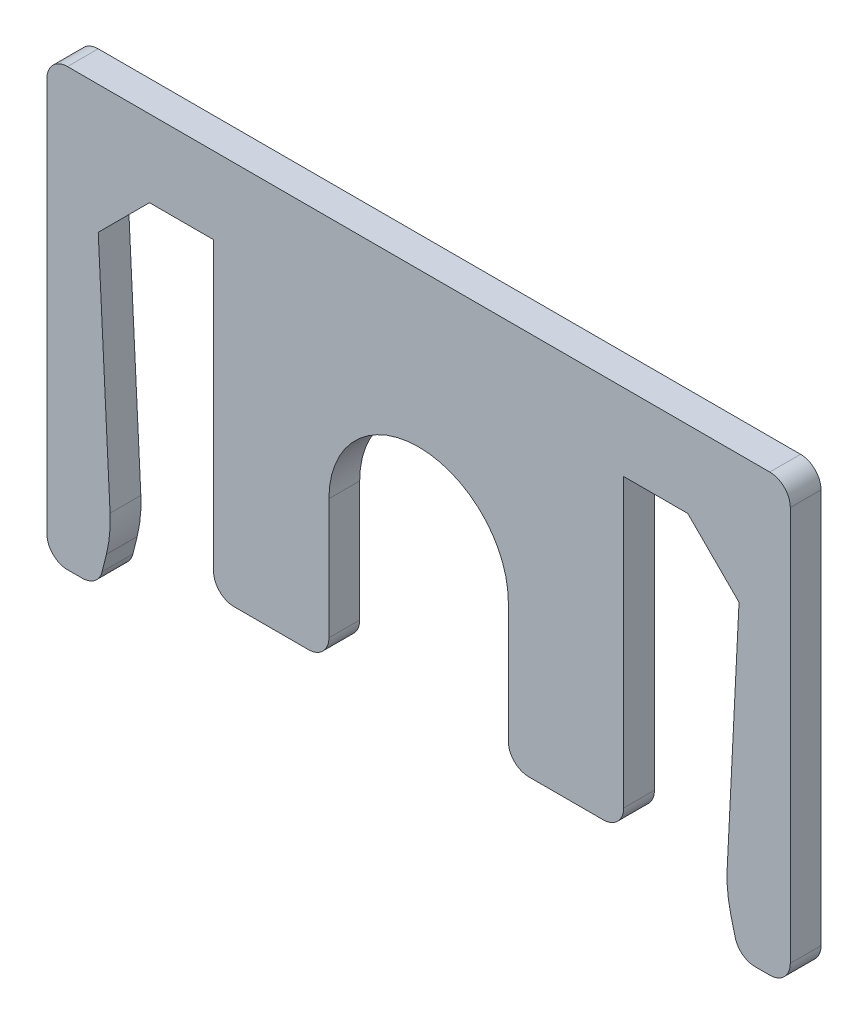
ISO-10303-21;
HEADER;
FILE_DESCRIPTION(('STEP AP214'),'2;1');
FILE_NAME('part.step','',(''),(''),'','','');
FILE_SCHEMA(('AUTOMOTIVE_DESIGN { 1 0 10303 214 1 1 1 1 }'));
ENDSEC;
DATA;
#1=APPLICATION_CONTEXT('core data for automotive mechanical design processes');
#2=APPLICATION_PROTOCOL_DEFINITION('international standard','automotive_design',2000,#1);
#3=PRODUCT_CONTEXT('',#1,'mechanical');
#4=PRODUCT('Part','Part','',(#3));
#5=PRODUCT_RELATED_PRODUCT_CATEGORY('part','',(#4));
#6=PRODUCT_DEFINITION_FORMATION('','',#4);
#7=PRODUCT_DEFINITION_CONTEXT('part definition',#1,'design');
#8=PRODUCT_DEFINITION('design','',#6,#7);
#9=PRODUCT_DEFINITION_SHAPE('','',#8);
#10=(LENGTH_UNIT() NAMED_UNIT(*) SI_UNIT(.MILLI.,.METRE.));
#11=(NAMED_UNIT(*) PLANE_ANGLE_UNIT() SI_UNIT($,.RADIAN.));
#12=(NAMED_UNIT(*) SI_UNIT($,.STERADIAN.) SOLID_ANGLE_UNIT());
#13=UNCERTAINTY_MEASURE_WITH_UNIT(LENGTH_MEASURE(1.E-05),#10,'distance_accuracy_value','');
#14=(GEOMETRIC_REPRESENTATION_CONTEXT(3) GLOBAL_UNCERTAINTY_ASSIGNED_CONTEXT((#13)) GLOBAL_UNIT_ASSIGNED_CONTEXT((#10,
#11,#12)) REPRESENTATION_CONTEXT('',''));
#15=CARTESIAN_POINT('',(0.,0.,0.));
#16=DIRECTION('',(0.,0.,1.));
#17=DIRECTION('',(1.,0.,0.));
#18=AXIS2_PLACEMENT_3D('',#15,#16,#17);
#19=CARTESIAN_POINT('',(-10.5,0.,1.2));
#20=DIRECTION('',(0.,1.,0.));
#21=DIRECTION('',(-1.,0.,0.));
#22=AXIS2_PLACEMENT_3D('',#19,#20,#21);
#23=PLANE('',#22);
#24=DIRECTION('',(1.,0.,0.));
#25=VECTOR('',#24,1.);
#26=CARTESIAN_POINT('',(-10.5,0.,0.));
#27=LINE('',#26,#25);
#28=CARTESIAN_POINT('',(-10.5,0.,0.));
#29=VERTEX_POINT('',#28);
#30=CARTESIAN_POINT('',(-8.,0.,0.));
#31=VERTEX_POINT('',#30);
#32=EDGE_CURVE('E277',#29,#31,#27,.T.);
#33=ORIENTED_EDGE('',*,*,#32,.T.);
#34=DIRECTION('',(0.,0.,-1.));
#35=VECTOR('',#34,1.);
#36=CARTESIAN_POINT('',(-8.,0.,1.2));
#37=LINE('',#36,#35);
#38=CARTESIAN_POINT('',(-8.,0.,1.2));
#39=VERTEX_POINT('',#38);
#40=EDGE_CURVE('E256',#39,#31,#37,.T.);
#41=ORIENTED_EDGE('',*,*,#40,.F.);
#42=DIRECTION('',(1.,0.,0.));
#43=VECTOR('',#42,1.);
#44=CARTESIAN_POINT('',(-10.5,0.,1.2));
#45=LINE('',#44,#43);
#46=CARTESIAN_POINT('',(-10.5,0.,1.2));
#47=VERTEX_POINT('',#46);
#48=EDGE_CURVE('E263',#47,#39,#45,.T.);
#49=ORIENTED_EDGE('',*,*,#48,.F.);
#50=DIRECTION('',(0.,0.,-1.));
#51=VECTOR('',#50,1.);
#52=CARTESIAN_POINT('',(-10.5,0.,1.2));
#53=LINE('',#52,#51);
#54=EDGE_CURVE('E518',#47,#29,#53,.T.);
#55=ORIENTED_EDGE('',*,*,#54,.T.);
#56=EDGE_LOOP('',(#33,#41,#49,#55));
#57=FACE_BOUND('',#56,.T.);
#58=ADVANCED_FACE('F39',(#57),#23,.F.);
#59=CARTESIAN_POINT('',(-8.,-12.,1.2));
#60=DIRECTION('',(1.,0.,0.));
#61=DIRECTION('',(0.,0.,-1.));
#62=AXIS2_PLACEMENT_3D('',#59,#60,#61);
#63=PLANE('',#62);
#64=DIRECTION('',(0.,-1.,0.));
#65=VECTOR('',#64,1.);
#66=CARTESIAN_POINT('',(-8.,-12.,0.));
#67=LINE('',#66,#65);
#68=CARTESIAN_POINT('',(-8.,-11.2,0.));
#69=VERTEX_POINT('',#68);
#70=EDGE_CURVE('E549',#31,#69,#67,.T.);
#71=ORIENTED_EDGE('',*,*,#70,.T.);
#72=DIRECTION('',(0.,0.,-1.));
#73=VECTOR('',#72,1.);
#74=CARTESIAN_POINT('',(-8.,-11.2,1.2));
#75=LINE('',#74,#73);
#76=CARTESIAN_POINT('',(-8.,-11.2,1.2));
#77=VERTEX_POINT('',#76);
#78=EDGE_CURVE('E259',#69,#77,#75,.F.);
#79=ORIENTED_EDGE('',*,*,#78,.T.);
#80=DIRECTION('',(0.,-1.,0.));
#81=VECTOR('',#80,1.);
#82=CARTESIAN_POINT('',(-8.,-12.,1.2));
#83=LINE('',#82,#81);
#84=EDGE_CURVE('E251',#39,#77,#83,.T.);
#85=ORIENTED_EDGE('',*,*,#84,.F.);
#86=ORIENTED_EDGE('',*,*,#40,.T.);
#87=EDGE_LOOP('',(#71,#79,#85,#86));
#88=FACE_BOUND('',#87,.T.);
#89=ADVANCED_FACE('F254',(#88),#63,.F.);
#90=CARTESIAN_POINT('',(-8.,-12.,1.2));
#91=DIRECTION('',(0.,1.,0.));
#92=DIRECTION('',(-1.,0.,0.));
#93=AXIS2_PLACEMENT_3D('',#90,#91,#92);
#94=PLANE('',#93);
#95=DIRECTION('',(1.,0.,0.));
#96=VECTOR('',#95,1.);
#97=CARTESIAN_POINT('',(-8.,-12.,1.2));
#98=LINE('',#97,#96);
#99=CARTESIAN_POINT('',(-7.2,-12.,1.2));
#100=VERTEX_POINT('',#99);
#101=CARTESIAN_POINT('',(-4.3,-12.,1.2));
#102=VERTEX_POINT('',#101);
#103=EDGE_CURVE('E262',#100,#102,#98,.T.);
#104=ORIENTED_EDGE('',*,*,#103,.F.);
#105=DIRECTION('',(0.,0.,-1.));
#106=VECTOR('',#105,1.);
#107=CARTESIAN_POINT('',(-7.2,-12.,1.2));
#108=LINE('',#107,#106);
#109=CARTESIAN_POINT('',(-7.2,-12.,0.));
#110=VERTEX_POINT('',#109);
#111=EDGE_CURVE('E418',#100,#110,#108,.T.);
#112=ORIENTED_EDGE('',*,*,#111,.T.);
#113=DIRECTION('',(1.,0.,0.));
#114=VECTOR('',#113,1.);
#115=CARTESIAN_POINT('',(-8.,-12.,0.));
#116=LINE('',#115,#114);
#117=CARTESIAN_POINT('',(-4.3,-12.,0.));
#118=VERTEX_POINT('',#117);
#119=EDGE_CURVE('E543',#110,#118,#116,.T.);
#120=ORIENTED_EDGE('',*,*,#119,.T.);
#121=DIRECTION('',(0.,0.,-1.));
#122=VECTOR('',#121,1.);
#123=CARTESIAN_POINT('',(-4.3,-12.,1.2));
#124=LINE('',#123,#122);
#125=EDGE_CURVE('E415',#118,#102,#124,.F.);
#126=ORIENTED_EDGE('',*,*,#125,.T.);
#127=EDGE_LOOP('',(#104,#112,#120,#126));
#128=FACE_BOUND('',#127,.T.);
#129=ADVANCED_FACE('F624',(#128),#94,.F.);
#130=CARTESIAN_POINT('',(-3.5,-6.5,1.2));
#131=DIRECTION('',(-1.,0.,0.));
#132=DIRECTION('',(0.,-1.,0.));
#133=AXIS2_PLACEMENT_3D('',#130,#131,#132);
#134=PLANE('',#133);
#135=DIRECTION('',(0.,1.,0.));
#136=VECTOR('',#135,1.);
#137=CARTESIAN_POINT('',(-3.5,-6.5,1.2));
#138=LINE('',#137,#136);
#139=CARTESIAN_POINT('',(-3.5,-11.2,1.2));
#140=VERTEX_POINT('',#139);
#141=CARTESIAN_POINT('',(-3.5,-6.5,1.2));
#142=VERTEX_POINT('',#141);
#143=EDGE_CURVE('E600',#140,#142,#138,.T.);
#144=ORIENTED_EDGE('',*,*,#143,.F.);
#145=DIRECTION('',(0.,0.,-1.));
#146=VECTOR('',#145,1.);
#147=CARTESIAN_POINT('',(-3.5,-11.2,1.2));
#148=LINE('',#147,#146);
#149=CARTESIAN_POINT('',(-3.5,-11.2,0.));
#150=VERTEX_POINT('',#149);
#151=EDGE_CURVE('E11',#140,#150,#148,.T.);
#152=ORIENTED_EDGE('',*,*,#151,.T.);
#153=DIRECTION('',(0.,1.,0.));
#154=VECTOR('',#153,1.);
#155=CARTESIAN_POINT('',(-3.5,-6.5,0.));
#156=LINE('',#155,#154);
#157=CARTESIAN_POINT('',(-3.5,-6.5,0.));
#158=VERTEX_POINT('',#157);
#159=EDGE_CURVE('E540',#150,#158,#156,.T.);
#160=ORIENTED_EDGE('',*,*,#159,.T.);
#161=DIRECTION('',(0.,0.,-1.));
#162=VECTOR('',#161,1.);
#163=CARTESIAN_POINT('',(-3.5,-6.5,1.2));
#164=LINE('',#163,#162);
#165=EDGE_CURVE('E280',#142,#158,#164,.T.);
#166=ORIENTED_EDGE('',*,*,#165,.F.);
#167=EDGE_LOOP('',(#144,#152,#160,#166));
#168=FACE_BOUND('',#167,.T.);
#169=ADVANCED_FACE('F614',(#168),#134,.F.);
#170=CARTESIAN_POINT('',(0.,-6.5,1.2));
#171=DIRECTION('',(0.,0.,-1.));
#172=DIRECTION('',(-1.,0.,0.));
#173=AXIS2_PLACEMENT_3D('',#170,#171,#172);
#174=CYLINDRICAL_SURFACE('',#173,3.5);
#175=CARTESIAN_POINT('',(0.,-6.5,0.));
#176=DIRECTION('',(0.,0.,-1.));
#177=DIRECTION('',(1.,0.,0.));
#178=AXIS2_PLACEMENT_3D('',#175,#176,#177);
#179=CIRCLE('',#178,3.5);
#180=CARTESIAN_POINT('',(3.5,-6.5,0.));
#181=VERTEX_POINT('',#180);
#182=EDGE_CURVE('E474',#158,#181,#179,.T.);
#183=ORIENTED_EDGE('',*,*,#182,.T.);
#184=DIRECTION('',(0.,0.,-1.));
#185=VECTOR('',#184,1.);
#186=CARTESIAN_POINT('',(3.5,-6.5,1.2));
#187=LINE('',#186,#185);
#188=CARTESIAN_POINT('',(3.5,-6.5,1.2));
#189=VERTEX_POINT('',#188);
#190=EDGE_CURVE('E288',#189,#181,#187,.T.);
#191=ORIENTED_EDGE('',*,*,#190,.F.);
#192=CARTESIAN_POINT('',(0.,-6.5,1.2));
#193=DIRECTION('',(0.,0.,-1.));
#194=DIRECTION('',(1.,0.,0.));
#195=AXIS2_PLACEMENT_3D('',#192,#193,#194);
#196=CIRCLE('',#195,3.5);
#197=EDGE_CURVE('E450',#142,#189,#196,.T.);
#198=ORIENTED_EDGE('',*,*,#197,.F.);
#199=ORIENTED_EDGE('',*,*,#165,.T.);
#200=EDGE_LOOP('',(#183,#191,#198,#199));
#201=FACE_BOUND('',#200,.T.);
#202=ADVANCED_FACE('F616',(#201),#174,.F.);
#203=CARTESIAN_POINT('',(3.5,-6.5,1.2));
#204=DIRECTION('',(1.,0.,0.));
#205=DIRECTION('',(0.,1.,0.));
#206=AXIS2_PLACEMENT_3D('',#203,#204,#205);
#207=PLANE('',#206);
#208=DIRECTION('',(0.,-1.,0.));
#209=VECTOR('',#208,1.);
#210=CARTESIAN_POINT('',(3.5,-6.5,0.));
#211=LINE('',#210,#209);
#212=CARTESIAN_POINT('',(3.5,-11.2,0.));
#213=VERTEX_POINT('',#212);
#214=EDGE_CURVE('E444',#181,#213,#211,.T.);
#215=ORIENTED_EDGE('',*,*,#214,.T.);
#216=DIRECTION('',(0.,0.,-1.));
#217=VECTOR('',#216,1.);
#218=CARTESIAN_POINT('',(3.5,-11.2,1.2));
#219=LINE('',#218,#217);
#220=CARTESIAN_POINT('',(3.5,-11.2,1.2));
#221=VERTEX_POINT('',#220);
#222=EDGE_CURVE('E48',#213,#221,#219,.F.);
#223=ORIENTED_EDGE('',*,*,#222,.T.);
#224=DIRECTION('',(0.,-1.,0.));
#225=VECTOR('',#224,1.);
#226=CARTESIAN_POINT('',(3.5,-6.5,1.2));
#227=LINE('',#226,#225);
#228=EDGE_CURVE('E442',#189,#221,#227,.T.);
#229=ORIENTED_EDGE('',*,*,#228,.F.);
#230=ORIENTED_EDGE('',*,*,#190,.T.);
#231=EDGE_LOOP('',(#215,#223,#229,#230));
#232=FACE_BOUND('',#231,.T.);
#233=ADVANCED_FACE('F440',(#232),#207,.F.);
#234=CARTESIAN_POINT('',(3.5,-12.,1.2));
#235=DIRECTION('',(0.,1.,0.));
#236=DIRECTION('',(-1.,0.,0.));
#237=AXIS2_PLACEMENT_3D('',#234,#235,#236);
#238=PLANE('',#237);
#239=DIRECTION('',(1.,0.,0.));
#240=VECTOR('',#239,1.);
#241=CARTESIAN_POINT('',(3.5,-12.,0.));
#242=LINE('',#241,#240);
#243=CARTESIAN_POINT('',(4.3,-12.,0.));
#244=VERTEX_POINT('',#243);
#245=CARTESIAN_POINT('',(7.2,-12.,0.));
#246=VERTEX_POINT('',#245);
#247=EDGE_CURVE('E461',#244,#246,#242,.T.);
#248=ORIENTED_EDGE('',*,*,#247,.T.);
#249=DIRECTION('',(0.,0.,-1.));
#250=VECTOR('',#249,1.);
#251=CARTESIAN_POINT('',(7.2,-12.,1.2));
#252=LINE('',#251,#250);
#253=CARTESIAN_POINT('',(7.2,-12.,1.2));
#254=VERTEX_POINT('',#253);
#255=EDGE_CURVE('E432',#246,#254,#252,.F.);
#256=ORIENTED_EDGE('',*,*,#255,.T.);
#257=DIRECTION('',(1.,0.,0.));
#258=VECTOR('',#257,1.);
#259=CARTESIAN_POINT('',(3.5,-12.,1.2));
#260=LINE('',#259,#258);
#261=CARTESIAN_POINT('',(4.3,-12.,1.2));
#262=VERTEX_POINT('',#261);
#263=EDGE_CURVE('E453',#262,#254,#260,.T.);
#264=ORIENTED_EDGE('',*,*,#263,.F.);
#265=DIRECTION('',(0.,0.,-1.));
#266=VECTOR('',#265,1.);
#267=CARTESIAN_POINT('',(4.3,-12.,1.2));
#268=LINE('',#267,#266);
#269=EDGE_CURVE('E428',#262,#244,#268,.T.);
#270=ORIENTED_EDGE('',*,*,#269,.T.);
#271=EDGE_LOOP('',(#248,#256,#264,#270));
#272=FACE_BOUND('',#271,.T.);
#273=ADVANCED_FACE('F460',(#272),#238,.F.);
#274=CARTESIAN_POINT('',(8.,-12.,1.2));
#275=DIRECTION('',(-1.,0.,0.));
#276=DIRECTION('',(0.,0.,1.));
#277=AXIS2_PLACEMENT_3D('',#274,#275,#276);
#278=PLANE('',#277);
#279=DIRECTION('',(0.,1.,0.));
#280=VECTOR('',#279,1.);
#281=CARTESIAN_POINT('',(8.,-12.,1.2));
#282=LINE('',#281,#280);
#283=CARTESIAN_POINT('',(8.,-11.2,1.2));
#284=VERTEX_POINT('',#283);
#285=CARTESIAN_POINT('',(8.,0.,1.2));
#286=VERTEX_POINT('',#285);
#287=EDGE_CURVE('E593',#284,#286,#282,.T.);
#288=ORIENTED_EDGE('',*,*,#287,.F.);
#289=DIRECTION('',(0.,0.,-1.));
#290=VECTOR('',#289,1.);
#291=CARTESIAN_POINT('',(8.,-11.2,1.2));
#292=LINE('',#291,#290);
#293=CARTESIAN_POINT('',(8.,-11.2,0.));
#294=VERTEX_POINT('',#293);
#295=EDGE_CURVE('E424',#284,#294,#292,.T.);
#296=ORIENTED_EDGE('',*,*,#295,.T.);
#297=DIRECTION('',(0.,1.,0.));
#298=VECTOR('',#297,1.);
#299=CARTESIAN_POINT('',(8.,-12.,0.));
#300=LINE('',#299,#298);
#301=CARTESIAN_POINT('',(8.,0.,0.));
#302=VERTEX_POINT('',#301);
#303=EDGE_CURVE('E468',#294,#302,#300,.T.);
#304=ORIENTED_EDGE('',*,*,#303,.T.);
#305=DIRECTION('',(0.,0.,-1.));
#306=VECTOR('',#305,1.);
#307=CARTESIAN_POINT('',(8.,0.,1.2));
#308=LINE('',#307,#306);
#309=EDGE_CURVE('E533',#286,#302,#308,.T.);
#310=ORIENTED_EDGE('',*,*,#309,.F.);
#311=EDGE_LOOP('',(#288,#296,#304,#310));
#312=FACE_BOUND('',#311,.T.);
#313=ADVANCED_FACE('F834',(#312),#278,.F.);
#314=CARTESIAN_POINT('',(8.,0.,1.2));
#315=DIRECTION('',(0.,1.,0.));
#316=DIRECTION('',(-1.,0.,0.));
#317=AXIS2_PLACEMENT_3D('',#314,#315,#316);
#318=PLANE('',#317);
#319=DIRECTION('',(1.,0.,0.));
#320=VECTOR('',#319,1.);
#321=CARTESIAN_POINT('',(8.,0.,0.));
#322=LINE('',#321,#320);
#323=CARTESIAN_POINT('',(10.5,0.,0.));
#324=VERTEX_POINT('',#323);
#325=EDGE_CURVE('E472',#302,#324,#322,.T.);
#326=ORIENTED_EDGE('',*,*,#325,.T.);
#327=DIRECTION('',(0.,0.,-1.));
#328=VECTOR('',#327,1.);
#329=CARTESIAN_POINT('',(10.5,0.,1.2));
#330=LINE('',#329,#328);
#331=CARTESIAN_POINT('',(10.5,0.,1.2));
#332=VERTEX_POINT('',#331);
#333=EDGE_CURVE('E529',#332,#324,#330,.T.);
#334=ORIENTED_EDGE('',*,*,#333,.F.);
#335=DIRECTION('',(1.,0.,0.));
#336=VECTOR('',#335,1.);
#337=CARTESIAN_POINT('',(8.,0.,1.2));
#338=LINE('',#337,#336);
#339=EDGE_CURVE('E590',#286,#332,#338,.T.);
#340=ORIENTED_EDGE('',*,*,#339,.F.);
#341=ORIENTED_EDGE('',*,*,#309,.T.);
#342=EDGE_LOOP('',(#326,#334,#340,#341));
#343=FACE_BOUND('',#342,.T.);
#344=ADVANCED_FACE('F839',(#343),#318,.F.);
#345=CARTESIAN_POINT('',(12.5,-2.,1.2));
#346=DIRECTION('',(0.707106781186547,0.707106781186548,0.));
#347=DIRECTION('',(-0.707106781186548,0.707106781186547,0.));
#348=AXIS2_PLACEMENT_3D('',#345,#346,#347);
#349=PLANE('',#348);
#350=DIRECTION('',(0.707106781186548,-0.707106781186547,0.));
#351=VECTOR('',#350,1.);
#352=CARTESIAN_POINT('',(12.5,-2.,0.));
#353=LINE('',#352,#351);
#354=CARTESIAN_POINT('',(12.5,-2.,0.));
#355=VERTEX_POINT('',#354);
#356=EDGE_CURVE('E480',#324,#355,#353,.T.);
#357=ORIENTED_EDGE('',*,*,#356,.T.);
#358=DIRECTION('',(0.,0.,-1.));
#359=VECTOR('',#358,1.);
#360=CARTESIAN_POINT('',(12.5,-2.,1.2));
#361=LINE('',#360,#359);
#362=CARTESIAN_POINT('',(12.5,-2.,1.2));
#363=VERTEX_POINT('',#362);
#364=EDGE_CURVE('E525',#363,#355,#361,.T.);
#365=ORIENTED_EDGE('',*,*,#364,.F.);
#366=DIRECTION('',(0.707106781186548,-0.707106781186547,0.));
#367=VECTOR('',#366,1.);
#368=CARTESIAN_POINT('',(12.5,-2.,1.2));
#369=LINE('',#368,#367);
#370=EDGE_CURVE('E587',#332,#363,#369,.T.);
#371=ORIENTED_EDGE('',*,*,#370,.F.);
#372=ORIENTED_EDGE('',*,*,#333,.T.);
#373=EDGE_LOOP('',(#357,#365,#371,#372));
#374=FACE_BOUND('',#373,.T.);
#375=ADVANCED_FACE('F901',(#374),#349,.F.);
#376=CARTESIAN_POINT('',(12.,-12.,1.2));
#377=DIRECTION('',(0.998752338877844,-0.0499376169438947,0.));
#378=DIRECTION('',(0.0499376169438947,0.998752338877845,0.));
#379=AXIS2_PLACEMENT_3D('',#376,#377,#378);
#380=PLANE('',#379);
#381=DIRECTION('',(-0.0499376169438947,-0.998752338877845,0.));
#382=VECTOR('',#381,1.);
#383=CARTESIAN_POINT('',(12.,-12.,0.));
#384=LINE('',#383,#382);
#385=CARTESIAN_POINT('',(12.0370903931354,-11.2581921372909,0.));
#386=VERTEX_POINT('',#385);
#387=EDGE_CURVE('E483',#355,#386,#384,.T.);
#388=ORIENTED_EDGE('',*,*,#387,.T.);
#389=DIRECTION('',(0.,0.,-1.));
#390=VECTOR('',#389,1.);
#391=CARTESIAN_POINT('',(12.0370903931354,-11.2581921372909,1.2));
#392=LINE('',#391,#390);
#393=CARTESIAN_POINT('',(12.0370903931354,-11.2581921372909,1.2));
#394=VERTEX_POINT('',#393);
#395=EDGE_CURVE('E312',#386,#394,#392,.F.);
#396=ORIENTED_EDGE('',*,*,#395,.T.);
#397=DIRECTION('',(-0.0499376169438947,-0.998752338877845,0.));
#398=VECTOR('',#397,1.);
#399=CARTESIAN_POINT('',(12.,-12.,1.2));
#400=LINE('',#399,#398);
#401=EDGE_CURVE('E583',#363,#394,#400,.T.);
#402=ORIENTED_EDGE('',*,*,#401,.F.);
#403=ORIENTED_EDGE('',*,*,#364,.T.);
#404=EDGE_LOOP('',(#388,#396,#402,#403));
#405=FACE_BOUND('',#404,.T.);
#406=ADVANCED_FACE('F826',(#405),#380,.F.);
#407=CARTESIAN_POINT('',(12.5,-14.,1.2));
#408=DIRECTION('',(0.970142500145332,0.242535625036332,0.));
#409=DIRECTION('',(-0.242535625036332,0.970142500145332,0.));
#410=AXIS2_PLACEMENT_3D('',#407,#408,#409);
#411=PLANE('',#410);
#412=DIRECTION('',(0.242535625036332,-0.970142500145332,0.));
#413=VECTOR('',#412,1.);
#414=CARTESIAN_POINT('',(12.5,-14.,0.));
#415=LINE('',#414,#413);
#416=CARTESIAN_POINT('',(12.180139586798,-12.7205583471921,0.));
#417=VERTEX_POINT('',#416);
#418=CARTESIAN_POINT('',(12.3485071250072,-13.3940285000291,0.));
#419=VERTEX_POINT('',#418);
#420=EDGE_CURVE('E487',#417,#419,#415,.T.);
#421=ORIENTED_EDGE('',*,*,#420,.T.);
#422=DIRECTION('',(0.,0.,-1.));
#423=VECTOR('',#422,1.);
#424=CARTESIAN_POINT('',(12.3485071250072,-13.3940285000291,1.2));
#425=LINE('',#424,#423);
#426=CARTESIAN_POINT('',(12.3485071250072,-13.3940285000291,1.2));
#427=VERTEX_POINT('',#426);
#428=EDGE_CURVE('E408',#419,#427,#425,.F.);
#429=ORIENTED_EDGE('',*,*,#428,.T.);
#430=DIRECTION('',(0.242535625036332,-0.970142500145332,0.));
#431=VECTOR('',#430,1.);
#432=CARTESIAN_POINT('',(12.5,-14.,1.2));
#433=LINE('',#432,#431);
#434=CARTESIAN_POINT('',(12.180139586798,-12.7205583471921,1.2));
#435=VERTEX_POINT('',#434);
#436=EDGE_CURVE('E579',#435,#427,#433,.T.);
#437=ORIENTED_EDGE('',*,*,#436,.F.);
#438=DIRECTION('',(0.,0.,-1.));
#439=VECTOR('',#438,1.);
#440=CARTESIAN_POINT('',(12.180139586798,-12.7205583471921,1.2));
#441=LINE('',#440,#439);
#442=EDGE_CURVE('E308',#435,#417,#441,.T.);
#443=ORIENTED_EDGE('',*,*,#442,.T.);
#444=EDGE_LOOP('',(#421,#429,#437,#443));
#445=FACE_BOUND('',#444,.T.);
#446=ADVANCED_FACE('F816',(#445),#411,.F.);
#447=CARTESIAN_POINT('',(12.5,-14.,1.2));
#448=DIRECTION('',(0.,1.,0.));
#449=DIRECTION('',(0.,0.,1.));
#450=AXIS2_PLACEMENT_3D('',#447,#448,#449);
#451=PLANE('',#450);
#452=DIRECTION('',(1.,0.,0.));
#453=VECTOR('',#452,1.);
#454=CARTESIAN_POINT('',(12.5,-14.,0.));
#455=LINE('',#454,#453);
#456=CARTESIAN_POINT('',(13.1246211251235,-14.,0.));
#457=VERTEX_POINT('',#456);
#458=CARTESIAN_POINT('',(13.7,-14.,0.));
#459=VERTEX_POINT('',#458);
#460=EDGE_CURVE('E491',#457,#459,#455,.T.);
#461=ORIENTED_EDGE('',*,*,#460,.T.);
#462=DIRECTION('',(0.,0.,-1.));
#463=VECTOR('',#462,1.);
#464=CARTESIAN_POINT('',(13.7,-14.,1.2));
#465=LINE('',#464,#463);
#466=CARTESIAN_POINT('',(13.7,-14.,1.2));
#467=VERTEX_POINT('',#466);
#468=EDGE_CURVE('E399',#459,#467,#465,.F.);
#469=ORIENTED_EDGE('',*,*,#468,.T.);
#470=DIRECTION('',(1.,0.,0.));
#471=VECTOR('',#470,1.);
#472=CARTESIAN_POINT('',(12.5,-14.,1.2));
#473=LINE('',#472,#471);
#474=CARTESIAN_POINT('',(13.1246211251235,-14.,1.2));
#475=VERTEX_POINT('',#474);
#476=EDGE_CURVE('E575',#475,#467,#473,.T.);
#477=ORIENTED_EDGE('',*,*,#476,.F.);
#478=DIRECTION('',(0.,0.,-1.));
#479=VECTOR('',#478,1.);
#480=CARTESIAN_POINT('',(13.1246211251235,-14.,1.2));
#481=LINE('',#480,#479);
#482=EDGE_CURVE('E395',#475,#457,#481,.T.);
#483=ORIENTED_EDGE('',*,*,#482,.T.);
#484=EDGE_LOOP('',(#461,#469,#477,#483));
#485=FACE_BOUND('',#484,.T.);
#486=ADVANCED_FACE('F805',(#485),#451,.F.);
#487=CARTESIAN_POINT('',(14.5,-14.,1.2));
#488=DIRECTION('',(-1.,0.,0.));
#489=DIRECTION('',(0.,0.,1.));
#490=AXIS2_PLACEMENT_3D('',#487,#488,#489);
#491=PLANE('',#490);
#492=DIRECTION('',(0.,1.,0.));
#493=VECTOR('',#492,1.);
#494=CARTESIAN_POINT('',(14.5,-14.,0.));
#495=LINE('',#494,#493);
#496=CARTESIAN_POINT('',(14.5,-13.2,0.));
#497=VERTEX_POINT('',#496);
#498=CARTESIAN_POINT('',(14.5,2.2,0.));
#499=VERTEX_POINT('',#498);
#500=EDGE_CURVE('E495',#497,#499,#495,.T.);
#501=ORIENTED_EDGE('',*,*,#500,.T.);
#502=DIRECTION('',(0.,0.,-1.));
#503=VECTOR('',#502,1.);
#504=CARTESIAN_POINT('',(14.5,2.2,1.2));
#505=LINE('',#504,#503);
#506=CARTESIAN_POINT('',(14.5,2.2,1.2));
#507=VERTEX_POINT('',#506);
#508=EDGE_CURVE('E356',#499,#507,#505,.F.);
#509=ORIENTED_EDGE('',*,*,#508,.T.);
#510=DIRECTION('',(0.,1.,0.));
#511=VECTOR('',#510,1.);
#512=CARTESIAN_POINT('',(14.5,-14.,1.2));
#513=LINE('',#512,#511);
#514=CARTESIAN_POINT('',(14.5,-13.2,1.2));
#515=VERTEX_POINT('',#514);
#516=EDGE_CURVE('E572',#515,#507,#513,.T.);
#517=ORIENTED_EDGE('',*,*,#516,.F.);
#518=DIRECTION('',(0.,0.,-1.));
#519=VECTOR('',#518,1.);
#520=CARTESIAN_POINT('',(14.5,-13.2,1.2));
#521=LINE('',#520,#519);
#522=EDGE_CURVE('E352',#515,#497,#521,.T.);
#523=ORIENTED_EDGE('',*,*,#522,.T.);
#524=EDGE_LOOP('',(#501,#509,#517,#523));
#525=FACE_BOUND('',#524,.T.);
#526=ADVANCED_FACE('F794',(#525),#491,.F.);
#527=CARTESIAN_POINT('',(-12.5,3.,1.2));
#528=DIRECTION('',(0.,-1.,0.));
#529=DIRECTION('',(1.,0.,0.));
#530=AXIS2_PLACEMENT_3D('',#527,#528,#529);
#531=PLANE('',#530);
#532=DIRECTION('',(-1.,0.,0.));
#533=VECTOR('',#532,1.);
#534=CARTESIAN_POINT('',(12.5,3.,1.2));
#535=LINE('',#534,#533);
#536=CARTESIAN_POINT('',(13.7,3.,1.2));
#537=VERTEX_POINT('',#536);
#538=CARTESIAN_POINT('',(-13.7,3.,1.2));
#539=VERTEX_POINT('',#538);
#540=EDGE_CURVE('E568',#537,#539,#535,.T.);
#541=ORIENTED_EDGE('',*,*,#540,.F.);
#542=DIRECTION('',(0.,0.,-1.));
#543=VECTOR('',#542,1.);
#544=CARTESIAN_POINT('',(13.7,3.,1.2));
#545=LINE('',#544,#543);
#546=CARTESIAN_POINT('',(13.7,3.,0.));
#547=VERTEX_POINT('',#546);
#548=EDGE_CURVE('E318',#537,#547,#545,.T.);
#549=ORIENTED_EDGE('',*,*,#548,.T.);
#550=DIRECTION('',(-1.,0.,0.));
#551=VECTOR('',#550,1.);
#552=CARTESIAN_POINT('',(-12.5,3.,0.));
#553=LINE('',#552,#551);
#554=CARTESIAN_POINT('',(-13.7,3.,0.));
#555=VERTEX_POINT('',#554);
#556=EDGE_CURVE('E499',#547,#555,#553,.T.);
#557=ORIENTED_EDGE('',*,*,#556,.T.);
#558=DIRECTION('',(0.,0.,-1.));
#559=VECTOR('',#558,1.);
#560=CARTESIAN_POINT('',(-13.7,3.,1.2));
#561=LINE('',#560,#559);
#562=EDGE_CURVE('E315',#555,#539,#561,.F.);
#563=ORIENTED_EDGE('',*,*,#562,.T.);
#564=EDGE_LOOP('',(#541,#549,#557,#563));
#565=FACE_BOUND('',#564,.T.);
#566=ADVANCED_FACE('F784',(#565),#531,.F.);
#567=CARTESIAN_POINT('',(-14.5,-14.,1.2));
#568=DIRECTION('',(1.,0.,0.));
#569=DIRECTION('',(0.,0.,-1.));
#570=AXIS2_PLACEMENT_3D('',#567,#568,#569);
#571=PLANE('',#570);
#572=DIRECTION('',(0.,-1.,0.));
#573=VECTOR('',#572,1.);
#574=CARTESIAN_POINT('',(-14.5,-14.,1.2));
#575=LINE('',#574,#573);
#576=CARTESIAN_POINT('',(-14.5,2.2,1.2));
#577=VERTEX_POINT('',#576);
#578=CARTESIAN_POINT('',(-14.5,-13.2,1.2));
#579=VERTEX_POINT('',#578);
#580=EDGE_CURVE('E565',#577,#579,#575,.T.);
#581=ORIENTED_EDGE('',*,*,#580,.F.);
#582=DIRECTION('',(0.,0.,-1.));
#583=VECTOR('',#582,1.);
#584=CARTESIAN_POINT('',(-14.5,2.2,1.2));
#585=LINE('',#584,#583);
#586=CARTESIAN_POINT('',(-14.5,2.2,0.));
#587=VERTEX_POINT('',#586);
#588=EDGE_CURVE('E391',#577,#587,#585,.T.);
#589=ORIENTED_EDGE('',*,*,#588,.T.);
#590=DIRECTION('',(0.,-1.,0.));
#591=VECTOR('',#590,1.);
#592=CARTESIAN_POINT('',(-14.5,-14.,0.));
#593=LINE('',#592,#591);
#594=CARTESIAN_POINT('',(-14.5,-13.2,0.));
#595=VERTEX_POINT('',#594);
#596=EDGE_CURVE('E503',#587,#595,#593,.T.);
#597=ORIENTED_EDGE('',*,*,#596,.T.);
#598=DIRECTION('',(0.,0.,-1.));
#599=VECTOR('',#598,1.);
#600=CARTESIAN_POINT('',(-14.5,-13.2,1.2));
#601=LINE('',#600,#599);
#602=EDGE_CURVE('E388',#595,#579,#601,.F.);
#603=ORIENTED_EDGE('',*,*,#602,.T.);
#604=EDGE_LOOP('',(#581,#589,#597,#603));
#605=FACE_BOUND('',#604,.T.);
#606=ADVANCED_FACE('F775',(#605),#571,.F.);
#607=CARTESIAN_POINT('',(-12.5,-14.,1.2));
#608=DIRECTION('',(0.,1.,0.));
#609=DIRECTION('',(0.,0.,1.));
#610=AXIS2_PLACEMENT_3D('',#607,#608,#609);
#611=PLANE('',#610);
#612=DIRECTION('',(1.,0.,0.));
#613=VECTOR('',#612,1.);
#614=CARTESIAN_POINT('',(-12.5,-14.,1.2));
#615=LINE('',#614,#613);
#616=CARTESIAN_POINT('',(-13.7,-14.,1.2));
#617=VERTEX_POINT('',#616);
#618=CARTESIAN_POINT('',(-13.1246211251235,-14.,1.2));
#619=VERTEX_POINT('',#618);
#620=EDGE_CURVE('E562',#617,#619,#615,.T.);
#621=ORIENTED_EDGE('',*,*,#620,.F.);
#622=DIRECTION('',(0.,0.,-1.));
#623=VECTOR('',#622,1.);
#624=CARTESIAN_POINT('',(-13.7,-14.,1.2));
#625=LINE('',#624,#623);
#626=CARTESIAN_POINT('',(-13.7,-14.,0.));
#627=VERTEX_POINT('',#626);
#628=EDGE_CURVE('E404',#617,#627,#625,.T.);
#629=ORIENTED_EDGE('',*,*,#628,.T.);
#630=DIRECTION('',(1.,0.,0.));
#631=VECTOR('',#630,1.);
#632=CARTESIAN_POINT('',(-12.5,-14.,0.));
#633=LINE('',#632,#631);
#634=CARTESIAN_POINT('',(-13.1246211251235,-14.,0.));
#635=VERTEX_POINT('',#634);
#636=EDGE_CURVE('E507',#627,#635,#633,.T.);
#637=ORIENTED_EDGE('',*,*,#636,.T.);
#638=DIRECTION('',(0.,0.,-1.));
#639=VECTOR('',#638,1.);
#640=CARTESIAN_POINT('',(-13.1246211251235,-14.,1.2));
#641=LINE('',#640,#639);
#642=EDGE_CURVE('E55',#635,#619,#641,.F.);
#643=ORIENTED_EDGE('',*,*,#642,.T.);
#644=EDGE_LOOP('',(#621,#629,#637,#643));
#645=FACE_BOUND('',#644,.T.);
#646=ADVANCED_FACE('F763',(#645),#611,.F.);
#647=CARTESIAN_POINT('',(-12.,-12.,1.2));
#648=DIRECTION('',(-0.970142500145332,0.242535625036333,0.));
#649=DIRECTION('',(-0.242535625036333,-0.970142500145332,0.));
#650=AXIS2_PLACEMENT_3D('',#647,#648,#649);
#651=PLANE('',#650);
#652=DIRECTION('',(0.242535625036333,0.970142500145332,0.));
#653=VECTOR('',#652,1.);
#654=CARTESIAN_POINT('',(-12.,-12.,1.2));
#655=LINE('',#654,#653);
#656=CARTESIAN_POINT('',(-12.3485071250073,-13.3940285000291,1.2));
#657=VERTEX_POINT('',#656);
#658=CARTESIAN_POINT('',(-12.180139586798,-12.7205583471921,1.2));
#659=VERTEX_POINT('',#658);
#660=EDGE_CURVE('E559',#657,#659,#655,.T.);
#661=ORIENTED_EDGE('',*,*,#660,.F.);
#662=DIRECTION('',(0.,0.,-1.));
#663=VECTOR('',#662,1.);
#664=CARTESIAN_POINT('',(-12.3485071250073,-13.3940285000291,1.2));
#665=LINE('',#664,#663);
#666=CARTESIAN_POINT('',(-12.3485071250073,-13.3940285000291,0.));
#667=VERTEX_POINT('',#666);
#668=EDGE_CURVE('E411',#657,#667,#665,.T.);
#669=ORIENTED_EDGE('',*,*,#668,.T.);
#670=DIRECTION('',(0.242535625036333,0.970142500145332,0.));
#671=VECTOR('',#670,1.);
#672=CARTESIAN_POINT('',(-12.,-12.,0.));
#673=LINE('',#672,#671);
#674=CARTESIAN_POINT('',(-12.180139586798,-12.7205583471921,0.));
#675=VERTEX_POINT('',#674);
#676=EDGE_CURVE('E510',#667,#675,#673,.T.);
#677=ORIENTED_EDGE('',*,*,#676,.T.);
#678=DIRECTION('',(0.,0.,-1.));
#679=VECTOR('',#678,1.);
#680=CARTESIAN_POINT('',(-12.180139586798,-12.7205583471921,1.2));
#681=LINE('',#680,#679);
#682=EDGE_CURVE('E298',#675,#659,#681,.F.);
#683=ORIENTED_EDGE('',*,*,#682,.T.);
#684=EDGE_LOOP('',(#661,#669,#677,#683));
#685=FACE_BOUND('',#684,.T.);
#686=ADVANCED_FACE('F757',(#685),#651,.F.);
#687=CARTESIAN_POINT('',(-12.5,-2.,1.2));
#688=DIRECTION('',(-0.998752338877845,-0.0499376169438921,0.));
#689=DIRECTION('',(0.0499376169438921,-0.998752338877845,0.));
#690=AXIS2_PLACEMENT_3D('',#687,#688,#689);
#691=PLANE('',#690);
#692=DIRECTION('',(-0.0499376169438921,0.998752338877845,0.));
#693=VECTOR('',#692,1.);
#694=CARTESIAN_POINT('',(-12.5,-2.,1.2));
#695=LINE('',#694,#693);
#696=CARTESIAN_POINT('',(-12.0370903931355,-11.2581921372909,1.2));
#697=VERTEX_POINT('',#696);
#698=CARTESIAN_POINT('',(-12.5,-2.,1.2));
#699=VERTEX_POINT('',#698);
#700=EDGE_CURVE('E556',#697,#699,#695,.T.);
#701=ORIENTED_EDGE('',*,*,#700,.F.);
#702=DIRECTION('',(0.,0.,-1.));
#703=VECTOR('',#702,1.);
#704=CARTESIAN_POINT('',(-12.0370903931355,-11.2581921372909,1.2));
#705=LINE('',#704,#703);
#706=CARTESIAN_POINT('',(-12.0370903931355,-11.2581921372909,0.));
#707=VERTEX_POINT('',#706);
#708=EDGE_CURVE('E279',#697,#707,#705,.T.);
#709=ORIENTED_EDGE('',*,*,#708,.T.);
#710=DIRECTION('',(-0.0499376169438921,0.998752338877845,0.));
#711=VECTOR('',#710,1.);
#712=CARTESIAN_POINT('',(-12.5,-2.,0.));
#713=LINE('',#712,#711);
#714=CARTESIAN_POINT('',(-12.5,-2.,0.));
#715=VERTEX_POINT('',#714);
#716=EDGE_CURVE('E513',#707,#715,#713,.T.);
#717=ORIENTED_EDGE('',*,*,#716,.T.);
#718=DIRECTION('',(0.,0.,-1.));
#719=VECTOR('',#718,1.);
#720=CARTESIAN_POINT('',(-12.5,-2.,1.2));
#721=LINE('',#720,#719);
#722=EDGE_CURVE('E521',#699,#715,#721,.T.);
#723=ORIENTED_EDGE('',*,*,#722,.F.);
#724=EDGE_LOOP('',(#701,#709,#717,#723));
#725=FACE_BOUND('',#724,.T.);
#726=ADVANCED_FACE('F762',(#725),#691,.F.);
#727=CARTESIAN_POINT('',(-10.5,0.,1.2));
#728=DIRECTION('',(-0.707106781186547,0.707106781186548,0.));
#729=DIRECTION('',(-0.707106781186548,-0.707106781186547,0.));
#730=AXIS2_PLACEMENT_3D('',#727,#728,#729);
#731=PLANE('',#730);
#732=DIRECTION('',(0.707106781186548,0.707106781186547,0.));
#733=VECTOR('',#732,1.);
#734=CARTESIAN_POINT('',(-10.5,0.,0.));
#735=LINE('',#734,#733);
#736=EDGE_CURVE('E274',#715,#29,#735,.T.);
#737=ORIENTED_EDGE('',*,*,#736,.T.);
#738=ORIENTED_EDGE('',*,*,#54,.F.);
#739=DIRECTION('',(0.707106781186548,0.707106781186547,0.));
#740=VECTOR('',#739,1.);
#741=CARTESIAN_POINT('',(-10.5,0.,1.2));
#742=LINE('',#741,#740);
#743=EDGE_CURVE('E269',#699,#47,#742,.T.);
#744=ORIENTED_EDGE('',*,*,#743,.F.);
#745=ORIENTED_EDGE('',*,*,#722,.T.);
#746=EDGE_LOOP('',(#737,#738,#744,#745));
#747=FACE_BOUND('',#746,.T.);
#748=ADVANCED_FACE('F750',(#747),#731,.F.);
#749=CARTESIAN_POINT('',(0.,-6.5,1.2));
#750=DIRECTION('',(0.,0.,1.));
#751=DIRECTION('',(1.,0.,0.));
#752=AXIS2_PLACEMENT_3D('',#749,#750,#751);
#753=PLANE('',#752);
#754=ORIENTED_EDGE('',*,*,#516,.T.);
#755=CARTESIAN_POINT('',(13.7,2.2,1.2));
#756=DIRECTION('',(0.,0.,1.));
#757=DIRECTION('',(1.,0.,0.));
#758=AXIS2_PLACEMENT_3D('',#755,#756,#757);
#759=CIRCLE('',#758,0.8);
#760=EDGE_CURVE('E385',#507,#537,#759,.T.);
#761=ORIENTED_EDGE('',*,*,#760,.T.);
#762=ORIENTED_EDGE('',*,*,#540,.T.);
#763=CARTESIAN_POINT('',(-13.7,2.2,1.2));
#764=DIRECTION('',(0.,0.,1.));
#765=DIRECTION('',(1.,0.,0.));
#766=AXIS2_PLACEMENT_3D('',#763,#764,#765);
#767=CIRCLE('',#766,0.8);
#768=EDGE_CURVE('E382',#539,#577,#767,.T.);
#769=ORIENTED_EDGE('',*,*,#768,.T.);
#770=ORIENTED_EDGE('',*,*,#580,.T.);
#771=CARTESIAN_POINT('',(-13.7,-13.2,1.2));
#772=DIRECTION('',(0.,0.,1.));
#773=DIRECTION('',(1.,0.,0.));
#774=AXIS2_PLACEMENT_3D('',#771,#772,#773);
#775=CIRCLE('',#774,0.8);
#776=EDGE_CURVE('E62',#579,#617,#775,.T.);
#777=ORIENTED_EDGE('',*,*,#776,.T.);
#778=ORIENTED_EDGE('',*,*,#620,.T.);
#779=CARTESIAN_POINT('',(-13.1246211251235,-13.2,1.2));
#780=DIRECTION('',(0.,0.,1.));
#781=DIRECTION('',(1.,0.,0.));
#782=AXIS2_PLACEMENT_3D('',#779,#780,#781);
#783=CIRCLE('',#782,0.8);
#784=EDGE_CURVE('E371',#619,#657,#783,.T.);
#785=ORIENTED_EDGE('',*,*,#784,.T.);
#786=ORIENTED_EDGE('',*,*,#660,.T.);
#787=CARTESIAN_POINT('',(-17.0308520875247,-11.5078802220104,1.2));
#788=DIRECTION('',(0.,0.,1.));
#789=DIRECTION('',(1.,0.,0.));
#790=AXIS2_PLACEMENT_3D('',#787,#788,#789);
#791=CIRCLE('',#790,5.);
#792=EDGE_CURVE('E305',#659,#697,#791,.T.);
#793=ORIENTED_EDGE('',*,*,#792,.T.);
#794=ORIENTED_EDGE('',*,*,#700,.T.);
#795=ORIENTED_EDGE('',*,*,#743,.T.);
#796=ORIENTED_EDGE('',*,*,#48,.T.);
#797=ORIENTED_EDGE('',*,*,#84,.T.);
#798=CARTESIAN_POINT('',(-7.2,-11.2,1.2));
#799=DIRECTION('',(0.,0.,1.));
#800=DIRECTION('',(1.,0.,0.));
#801=AXIS2_PLACEMENT_3D('',#798,#799,#800);
#802=CIRCLE('',#801,0.8);
#803=EDGE_CURVE('E368',#77,#100,#802,.T.);
#804=ORIENTED_EDGE('',*,*,#803,.T.);
#805=ORIENTED_EDGE('',*,*,#103,.T.);
#806=CARTESIAN_POINT('',(-4.3,-11.2,1.2));
#807=DIRECTION('',(0.,0.,1.));
#808=DIRECTION('',(1.,0.,0.));
#809=AXIS2_PLACEMENT_3D('',#806,#807,#808);
#810=CIRCLE('',#809,0.8);
#811=EDGE_CURVE('E359',#102,#140,#810,.T.);
#812=ORIENTED_EDGE('',*,*,#811,.T.);
#813=ORIENTED_EDGE('',*,*,#143,.T.);
#814=ORIENTED_EDGE('',*,*,#197,.T.);
#815=ORIENTED_EDGE('',*,*,#228,.T.);
#816=CARTESIAN_POINT('',(4.3,-11.2,1.2));
#817=DIRECTION('',(0.,0.,1.));
#818=DIRECTION('',(1.,0.,0.));
#819=AXIS2_PLACEMENT_3D('',#816,#817,#818);
#820=CIRCLE('',#819,0.8);
#821=EDGE_CURVE('E362',#221,#262,#820,.T.);
#822=ORIENTED_EDGE('',*,*,#821,.T.);
#823=ORIENTED_EDGE('',*,*,#263,.T.);
#824=CARTESIAN_POINT('',(7.2,-11.2,1.2));
#825=DIRECTION('',(0.,0.,1.));
#826=DIRECTION('',(1.,0.,0.));
#827=AXIS2_PLACEMENT_3D('',#824,#825,#826);
#828=CIRCLE('',#827,0.8);
#829=EDGE_CURVE('E365',#254,#284,#828,.T.);
#830=ORIENTED_EDGE('',*,*,#829,.T.);
#831=ORIENTED_EDGE('',*,*,#287,.T.);
#832=ORIENTED_EDGE('',*,*,#339,.T.);
#833=ORIENTED_EDGE('',*,*,#370,.T.);
#834=ORIENTED_EDGE('',*,*,#401,.T.);
#835=CARTESIAN_POINT('',(17.0308520875247,-11.5078802220104,1.2));
#836=DIRECTION('',(0.,0.,1.));
#837=DIRECTION('',(1.,0.,0.));
#838=AXIS2_PLACEMENT_3D('',#835,#836,#837);
#839=CIRCLE('',#838,5.);
#840=EDGE_CURVE('E302',#394,#435,#839,.T.);
#841=ORIENTED_EDGE('',*,*,#840,.T.);
#842=ORIENTED_EDGE('',*,*,#436,.T.);
#843=CARTESIAN_POINT('',(13.1246211251235,-13.2,1.2));
#844=DIRECTION('',(0.,0.,1.));
#845=DIRECTION('',(1.,0.,0.));
#846=AXIS2_PLACEMENT_3D('',#843,#844,#845);
#847=CIRCLE('',#846,0.8);
#848=EDGE_CURVE('E374',#427,#475,#847,.T.);
#849=ORIENTED_EDGE('',*,*,#848,.T.);
#850=ORIENTED_EDGE('',*,*,#476,.T.);
#851=CARTESIAN_POINT('',(13.7,-13.2,1.2));
#852=DIRECTION('',(0.,0.,1.));
#853=DIRECTION('',(1.,0.,0.));
#854=AXIS2_PLACEMENT_3D('',#851,#852,#853);
#855=CIRCLE('',#854,0.8);
#856=EDGE_CURVE('E379',#467,#515,#855,.T.);
#857=ORIENTED_EDGE('',*,*,#856,.T.);
#858=EDGE_LOOP('',(#754,#761,#762,#769,#770,#777,#778,#785,#786,#793,#794,#795,#796,#797,#804,
#805,#812,#813,#814,#815,#822,#823,#830,#831,#832,#833,#834,#841,#842,#849,#850,#857));
#859=FACE_BOUND('',#858,.T.);
#860=ADVANCED_FACE('F267',(#859),#753,.T.);
#861=CARTESIAN_POINT('',(0.,-6.5,0.));
#862=DIRECTION('',(0.,0.,1.));
#863=DIRECTION('',(1.,0.,0.));
#864=AXIS2_PLACEMENT_3D('',#861,#862,#863);
#865=PLANE('',#864);
#866=ORIENTED_EDGE('',*,*,#556,.F.);
#867=CARTESIAN_POINT('',(13.7,2.2,0.));
#868=DIRECTION('',(0.,0.,1.));
#869=DIRECTION('',(1.,0.,0.));
#870=AXIS2_PLACEMENT_3D('',#867,#868,#869);
#871=CIRCLE('',#870,0.8);
#872=EDGE_CURVE('E349',#547,#499,#871,.F.);
#873=ORIENTED_EDGE('',*,*,#872,.T.);
#874=ORIENTED_EDGE('',*,*,#500,.F.);
#875=CARTESIAN_POINT('',(13.7,-13.2,0.));
#876=DIRECTION('',(0.,0.,1.));
#877=DIRECTION('',(1.,0.,0.));
#878=AXIS2_PLACEMENT_3D('',#875,#876,#877);
#879=CIRCLE('',#878,0.8);
#880=EDGE_CURVE('E343',#497,#459,#879,.F.);
#881=ORIENTED_EDGE('',*,*,#880,.T.);
#882=ORIENTED_EDGE('',*,*,#460,.F.);
#883=CARTESIAN_POINT('',(13.1246211251235,-13.2,0.));
#884=DIRECTION('',(0.,0.,1.));
#885=DIRECTION('',(1.,0.,0.));
#886=AXIS2_PLACEMENT_3D('',#883,#884,#885);
#887=CIRCLE('',#886,0.8);
#888=EDGE_CURVE('E337',#457,#419,#887,.F.);
#889=ORIENTED_EDGE('',*,*,#888,.T.);
#890=ORIENTED_EDGE('',*,*,#420,.F.);
#891=CARTESIAN_POINT('',(17.0308520875247,-11.5078802220104,0.));
#892=DIRECTION('',(0.,0.,1.));
#893=DIRECTION('',(1.,0.,0.));
#894=AXIS2_PLACEMENT_3D('',#891,#892,#893);
#895=CIRCLE('',#894,5.);
#896=EDGE_CURVE('E285',#417,#386,#895,.F.);
#897=ORIENTED_EDGE('',*,*,#896,.T.);
#898=ORIENTED_EDGE('',*,*,#387,.F.);
#899=ORIENTED_EDGE('',*,*,#356,.F.);
#900=ORIENTED_EDGE('',*,*,#325,.F.);
#901=ORIENTED_EDGE('',*,*,#303,.F.);
#902=CARTESIAN_POINT('',(7.2,-11.2,0.));
#903=DIRECTION('',(0.,0.,1.));
#904=DIRECTION('',(1.,0.,0.));
#905=AXIS2_PLACEMENT_3D('',#902,#903,#904);
#906=CIRCLE('',#905,0.8);
#907=EDGE_CURVE('E328',#294,#246,#906,.F.);
#908=ORIENTED_EDGE('',*,*,#907,.T.);
#909=ORIENTED_EDGE('',*,*,#247,.F.);
#910=CARTESIAN_POINT('',(4.3,-11.2,0.));
#911=DIRECTION('',(0.,0.,1.));
#912=DIRECTION('',(1.,0.,0.));
#913=AXIS2_PLACEMENT_3D('',#910,#911,#912);
#914=CIRCLE('',#913,0.8);
#915=EDGE_CURVE('E325',#244,#213,#914,.F.);
#916=ORIENTED_EDGE('',*,*,#915,.T.);
#917=ORIENTED_EDGE('',*,*,#214,.F.);
#918=ORIENTED_EDGE('',*,*,#182,.F.);
#919=ORIENTED_EDGE('',*,*,#159,.F.);
#920=CARTESIAN_POINT('',(-4.3,-11.2,0.));
#921=DIRECTION('',(0.,0.,1.));
#922=DIRECTION('',(1.,0.,0.));
#923=AXIS2_PLACEMENT_3D('',#920,#921,#922);
#924=CIRCLE('',#923,0.8);
#925=EDGE_CURVE('E322',#150,#118,#924,.F.);
#926=ORIENTED_EDGE('',*,*,#925,.T.);
#927=ORIENTED_EDGE('',*,*,#119,.F.);
#928=CARTESIAN_POINT('',(-7.2,-11.2,0.));
#929=DIRECTION('',(0.,0.,1.));
#930=DIRECTION('',(1.,0.,0.));
#931=AXIS2_PLACEMENT_3D('',#928,#929,#930);
#932=CIRCLE('',#931,0.8);
#933=EDGE_CURVE('E331',#110,#69,#932,.F.);
#934=ORIENTED_EDGE('',*,*,#933,.T.);
#935=ORIENTED_EDGE('',*,*,#70,.F.);
#936=ORIENTED_EDGE('',*,*,#32,.F.);
#937=ORIENTED_EDGE('',*,*,#736,.F.);
#938=ORIENTED_EDGE('',*,*,#716,.F.);
#939=CARTESIAN_POINT('',(-17.0308520875247,-11.5078802220104,0.));
#940=DIRECTION('',(0.,0.,1.));
#941=DIRECTION('',(1.,0.,0.));
#942=AXIS2_PLACEMENT_3D('',#939,#940,#941);
#943=CIRCLE('',#942,5.);
#944=EDGE_CURVE('E294',#707,#675,#943,.F.);
#945=ORIENTED_EDGE('',*,*,#944,.T.);
#946=ORIENTED_EDGE('',*,*,#676,.F.);
#947=CARTESIAN_POINT('',(-13.1246211251235,-13.2,0.));
#948=DIRECTION('',(0.,0.,1.));
#949=DIRECTION('',(1.,0.,0.));
#950=AXIS2_PLACEMENT_3D('',#947,#948,#949);
#951=CIRCLE('',#950,0.8);
#952=EDGE_CURVE('E334',#667,#635,#951,.F.);
#953=ORIENTED_EDGE('',*,*,#952,.T.);
#954=ORIENTED_EDGE('',*,*,#636,.F.);
#955=CARTESIAN_POINT('',(-13.7,-13.2,0.));
#956=DIRECTION('',(0.,0.,1.));
#957=DIRECTION('',(1.,0.,0.));
#958=AXIS2_PLACEMENT_3D('',#955,#956,#957);
#959=CIRCLE('',#958,0.8);
#960=EDGE_CURVE('E340',#627,#595,#959,.F.);
#961=ORIENTED_EDGE('',*,*,#960,.T.);
#962=ORIENTED_EDGE('',*,*,#596,.F.);
#963=CARTESIAN_POINT('',(-13.7,2.2,0.));
#964=DIRECTION('',(0.,0.,1.));
#965=DIRECTION('',(1.,0.,0.));
#966=AXIS2_PLACEMENT_3D('',#963,#964,#965);
#967=CIRCLE('',#966,0.8);
#968=EDGE_CURVE('E346',#587,#555,#967,.F.);
#969=ORIENTED_EDGE('',*,*,#968,.T.);
#970=EDGE_LOOP('',(#866,#873,#874,#881,#882,#889,#890,#897,#898,#899,#900,#901,#908,#909,#916,
#917,#918,#919,#926,#927,#934,#935,#936,#937,#938,#945,#946,#953,#954,#961,#962,#969));
#971=FACE_BOUND('',#970,.T.);
#972=ADVANCED_FACE('F465',(#971),#865,.F.);
#973=CARTESIAN_POINT('',(-17.0308520875247,-11.5078802220104,1.2));
#974=DIRECTION('',(0.,0.,-1.));
#975=DIRECTION('',(-1.,0.,0.));
#976=AXIS2_PLACEMENT_3D('',#973,#974,#975);
#977=CYLINDRICAL_SURFACE('',#976,5.);
#978=ORIENTED_EDGE('',*,*,#792,.F.);
#979=ORIENTED_EDGE('',*,*,#682,.F.);
#980=ORIENTED_EDGE('',*,*,#944,.F.);
#981=ORIENTED_EDGE('',*,*,#708,.F.);
#982=EDGE_LOOP('',(#978,#979,#980,#981));
#983=FACE_BOUND('',#982,.T.);
#984=ADVANCED_FACE('F634',(#983),#977,.T.);
#985=CARTESIAN_POINT('',(17.0308520875247,-11.5078802220104,1.2));
#986=DIRECTION('',(0.,0.,-1.));
#987=DIRECTION('',(-1.,0.,0.));
#988=AXIS2_PLACEMENT_3D('',#985,#986,#987);
#989=CYLINDRICAL_SURFACE('',#988,5.);
#990=ORIENTED_EDGE('',*,*,#840,.F.);
#991=ORIENTED_EDGE('',*,*,#395,.F.);
#992=ORIENTED_EDGE('',*,*,#896,.F.);
#993=ORIENTED_EDGE('',*,*,#442,.F.);
#994=EDGE_LOOP('',(#990,#991,#992,#993));
#995=FACE_BOUND('',#994,.T.);
#996=ADVANCED_FACE('F637',(#995),#989,.T.);
#997=CARTESIAN_POINT('',(13.7,2.2,1.2));
#998=DIRECTION('',(0.,0.,-1.));
#999=DIRECTION('',(-1.,0.,0.));
#1000=AXIS2_PLACEMENT_3D('',#997,#998,#999);
#1001=CYLINDRICAL_SURFACE('',#1000,0.8);
#1002=ORIENTED_EDGE('',*,*,#760,.F.);
#1003=ORIENTED_EDGE('',*,*,#508,.F.);
#1004=ORIENTED_EDGE('',*,*,#872,.F.);
#1005=ORIENTED_EDGE('',*,*,#548,.F.);
#1006=EDGE_LOOP('',(#1002,#1003,#1004,#1005));
#1007=FACE_BOUND('',#1006,.T.);
#1008=ADVANCED_FACE('F641',(#1007),#1001,.T.);
#1009=CARTESIAN_POINT('',(-13.7,2.2,1.2));
#1010=DIRECTION('',(0.,0.,-1.));
#1011=DIRECTION('',(-1.,0.,0.));
#1012=AXIS2_PLACEMENT_3D('',#1009,#1010,#1011);
#1013=CYLINDRICAL_SURFACE('',#1012,0.8);
#1014=ORIENTED_EDGE('',*,*,#768,.F.);
#1015=ORIENTED_EDGE('',*,*,#562,.F.);
#1016=ORIENTED_EDGE('',*,*,#968,.F.);
#1017=ORIENTED_EDGE('',*,*,#588,.F.);
#1018=EDGE_LOOP('',(#1014,#1015,#1016,#1017));
#1019=FACE_BOUND('',#1018,.T.);
#1020=ADVANCED_FACE('F645',(#1019),#1013,.T.);
#1021=CARTESIAN_POINT('',(13.7,-13.2,1.2));
#1022=DIRECTION('',(0.,0.,-1.));
#1023=DIRECTION('',(-1.,0.,0.));
#1024=AXIS2_PLACEMENT_3D('',#1021,#1022,#1023);
#1025=CYLINDRICAL_SURFACE('',#1024,0.8);
#1026=ORIENTED_EDGE('',*,*,#856,.F.);
#1027=ORIENTED_EDGE('',*,*,#468,.F.);
#1028=ORIENTED_EDGE('',*,*,#880,.F.);
#1029=ORIENTED_EDGE('',*,*,#522,.F.);
#1030=EDGE_LOOP('',(#1026,#1027,#1028,#1029));
#1031=FACE_BOUND('',#1030,.T.);
#1032=ADVANCED_FACE('F649',(#1031),#1025,.T.);
#1033=CARTESIAN_POINT('',(-13.7,-13.2,1.2));
#1034=DIRECTION('',(0.,0.,-1.));
#1035=DIRECTION('',(-1.,0.,0.));
#1036=AXIS2_PLACEMENT_3D('',#1033,#1034,#1035);
#1037=CYLINDRICAL_SURFACE('',#1036,0.8);
#1038=ORIENTED_EDGE('',*,*,#776,.F.);
#1039=ORIENTED_EDGE('',*,*,#602,.F.);
#1040=ORIENTED_EDGE('',*,*,#960,.F.);
#1041=ORIENTED_EDGE('',*,*,#628,.F.);
#1042=EDGE_LOOP('',(#1038,#1039,#1040,#1041));
#1043=FACE_BOUND('',#1042,.T.);
#1044=ADVANCED_FACE('F653',(#1043),#1037,.T.);
#1045=CARTESIAN_POINT('',(13.1246211251235,-13.2,1.2));
#1046=DIRECTION('',(0.,0.,-1.));
#1047=DIRECTION('',(-1.,0.,0.));
#1048=AXIS2_PLACEMENT_3D('',#1045,#1046,#1047);
#1049=CYLINDRICAL_SURFACE('',#1048,0.8);
#1050=ORIENTED_EDGE('',*,*,#848,.F.);
#1051=ORIENTED_EDGE('',*,*,#428,.F.);
#1052=ORIENTED_EDGE('',*,*,#888,.F.);
#1053=ORIENTED_EDGE('',*,*,#482,.F.);
#1054=EDGE_LOOP('',(#1050,#1051,#1052,#1053));
#1055=FACE_BOUND('',#1054,.T.);
#1056=ADVANCED_FACE('F657',(#1055),#1049,.T.);
#1057=CARTESIAN_POINT('',(-13.1246211251235,-13.2,1.2));
#1058=DIRECTION('',(0.,0.,-1.));
#1059=DIRECTION('',(-1.,0.,0.));
#1060=AXIS2_PLACEMENT_3D('',#1057,#1058,#1059);
#1061=CYLINDRICAL_SURFACE('',#1060,0.8);
#1062=ORIENTED_EDGE('',*,*,#784,.F.);
#1063=ORIENTED_EDGE('',*,*,#642,.F.);
#1064=ORIENTED_EDGE('',*,*,#952,.F.);
#1065=ORIENTED_EDGE('',*,*,#668,.F.);
#1066=EDGE_LOOP('',(#1062,#1063,#1064,#1065));
#1067=FACE_BOUND('',#1066,.T.);
#1068=ADVANCED_FACE('F661',(#1067),#1061,.T.);
#1069=CARTESIAN_POINT('',(-7.2,-11.2,1.2));
#1070=DIRECTION('',(0.,0.,-1.));
#1071=DIRECTION('',(-1.,0.,0.));
#1072=AXIS2_PLACEMENT_3D('',#1069,#1070,#1071);
#1073=CYLINDRICAL_SURFACE('',#1072,0.8);
#1074=ORIENTED_EDGE('',*,*,#803,.F.);
#1075=ORIENTED_EDGE('',*,*,#78,.F.);
#1076=ORIENTED_EDGE('',*,*,#933,.F.);
#1077=ORIENTED_EDGE('',*,*,#111,.F.);
#1078=EDGE_LOOP('',(#1074,#1075,#1076,#1077));
#1079=FACE_BOUND('',#1078,.T.);
#1080=ADVANCED_FACE('F665',(#1079),#1073,.T.);
#1081=CARTESIAN_POINT('',(7.2,-11.2,1.2));
#1082=DIRECTION('',(0.,0.,-1.));
#1083=DIRECTION('',(-1.,0.,0.));
#1084=AXIS2_PLACEMENT_3D('',#1081,#1082,#1083);
#1085=CYLINDRICAL_SURFACE('',#1084,0.8);
#1086=ORIENTED_EDGE('',*,*,#829,.F.);
#1087=ORIENTED_EDGE('',*,*,#255,.F.);
#1088=ORIENTED_EDGE('',*,*,#907,.F.);
#1089=ORIENTED_EDGE('',*,*,#295,.F.);
#1090=EDGE_LOOP('',(#1086,#1087,#1088,#1089));
#1091=FACE_BOUND('',#1090,.T.);
#1092=ADVANCED_FACE('F669',(#1091),#1085,.T.);
#1093=CARTESIAN_POINT('',(4.3,-11.2,1.2));
#1094=DIRECTION('',(0.,0.,-1.));
#1095=DIRECTION('',(-1.,0.,0.));
#1096=AXIS2_PLACEMENT_3D('',#1093,#1094,#1095);
#1097=CYLINDRICAL_SURFACE('',#1096,0.8);
#1098=ORIENTED_EDGE('',*,*,#821,.F.);
#1099=ORIENTED_EDGE('',*,*,#222,.F.);
#1100=ORIENTED_EDGE('',*,*,#915,.F.);
#1101=ORIENTED_EDGE('',*,*,#269,.F.);
#1102=EDGE_LOOP('',(#1098,#1099,#1100,#1101));
#1103=FACE_BOUND('',#1102,.T.);
#1104=ADVANCED_FACE('F456',(#1103),#1097,.T.);
#1105=CARTESIAN_POINT('',(-4.3,-11.2,1.2));
#1106=DIRECTION('',(0.,0.,-1.));
#1107=DIRECTION('',(-1.,0.,0.));
#1108=AXIS2_PLACEMENT_3D('',#1105,#1106,#1107);
#1109=CYLINDRICAL_SURFACE('',#1108,0.8);
#1110=ORIENTED_EDGE('',*,*,#811,.F.);
#1111=ORIENTED_EDGE('',*,*,#125,.F.);
#1112=ORIENTED_EDGE('',*,*,#925,.F.);
#1113=ORIENTED_EDGE('',*,*,#151,.F.);
#1114=EDGE_LOOP('',(#1110,#1111,#1112,#1113));
#1115=FACE_BOUND('',#1114,.T.);
#1116=ADVANCED_FACE('F41',(#1115),#1109,.T.);
#1117=CLOSED_SHELL('',(#58,#89,#129,#169,#202,#233,#273,#313,#344,#375,#406,#446,#486,#526,#566,
#606,#646,#686,#726,#748,#860,#972,#984,#996,#1008,#1020,#1032,#1044,#1056,#1068,#1080,#1092,
#1104,#1116));
#1118=MANIFOLD_SOLID_BREP('B2',#1117);
#1119=ADVANCED_BREP_SHAPE_REPRESENTATION('',(#18,#1118),#14);
#1120=SHAPE_DEFINITION_REPRESENTATION(#9,#1119);
ENDSEC;
END-ISO-10303-21;
